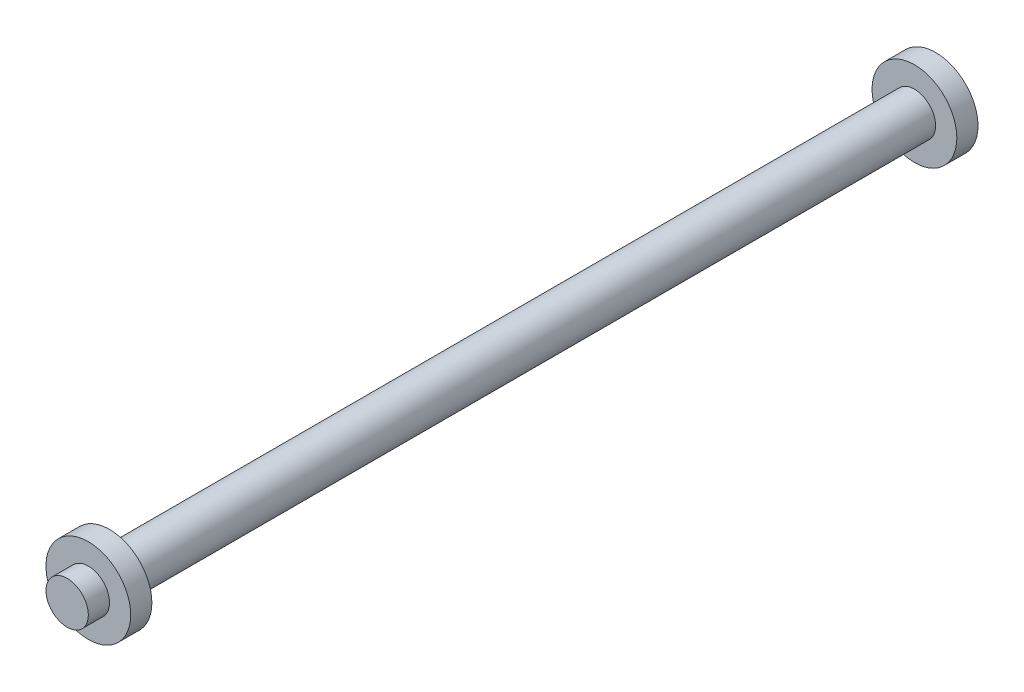
ISO-10303-21;
HEADER;
FILE_DESCRIPTION(('STEP AP214'),'2;1');
FILE_NAME('part.step','',(''),(''),'','','');
FILE_SCHEMA(('AUTOMOTIVE_DESIGN { 1 0 10303 214 1 1 1 1 }'));
ENDSEC;
DATA;
#1=APPLICATION_CONTEXT('core data for automotive mechanical design processes');
#2=APPLICATION_PROTOCOL_DEFINITION('international standard','automotive_design',2000,#1);
#3=PRODUCT_CONTEXT('',#1,'mechanical');
#4=PRODUCT('Part','Part','',(#3));
#5=PRODUCT_RELATED_PRODUCT_CATEGORY('part','',(#4));
#6=PRODUCT_DEFINITION_FORMATION('','',#4);
#7=PRODUCT_DEFINITION_CONTEXT('part definition',#1,'design');
#8=PRODUCT_DEFINITION('design','',#6,#7);
#9=PRODUCT_DEFINITION_SHAPE('','',#8);
#10=(LENGTH_UNIT() NAMED_UNIT(*) SI_UNIT(.MILLI.,.METRE.));
#11=(NAMED_UNIT(*) PLANE_ANGLE_UNIT() SI_UNIT($,.RADIAN.));
#12=(NAMED_UNIT(*) SI_UNIT($,.STERADIAN.) SOLID_ANGLE_UNIT());
#13=UNCERTAINTY_MEASURE_WITH_UNIT(LENGTH_MEASURE(1.E-05),#10,'distance_accuracy_value','');
#14=(GEOMETRIC_REPRESENTATION_CONTEXT(3) GLOBAL_UNCERTAINTY_ASSIGNED_CONTEXT((#13)) GLOBAL_UNIT_ASSIGNED_CONTEXT((#10,
#11,#12)) REPRESENTATION_CONTEXT('',''));
#15=CARTESIAN_POINT('',(0.,0.,0.));
#16=DIRECTION('',(0.,0.,1.));
#17=DIRECTION('',(1.,0.,0.));
#18=AXIS2_PLACEMENT_3D('',#15,#16,#17);
#19=CARTESIAN_POINT('',(0.,0.,-380.));
#20=DIRECTION('',(0.,0.,-1.));
#21=DIRECTION('',(-1.,0.,0.));
#22=AXIS2_PLACEMENT_3D('',#19,#20,#21);
#23=PLANE('',#22);
#24=CARTESIAN_POINT('',(0.,0.,-380.));
#25=DIRECTION('',(0.,0.,-1.));
#26=DIRECTION('',(1.,0.,0.));
#27=AXIS2_PLACEMENT_3D('',#24,#25,#26);
#28=CIRCLE('',#27,10.);
#29=CARTESIAN_POINT('',(10.,1.69E-13,-380.));
#30=VERTEX_POINT('',#29);
#31=EDGE_CURVE('E89',#30,#30,#28,.T.);
#32=ORIENTED_EDGE('',*,*,#31,.T.);
#33=EDGE_LOOP('',(#32));
#34=FACE_BOUND('',#33,.T.);
#35=CARTESIAN_POINT('',(0.,0.,-380.));
#36=DIRECTION('',(0.,0.,-1.));
#37=DIRECTION('',(1.,0.,0.));
#38=AXIS2_PLACEMENT_3D('',#35,#36,#37);
#39=CIRCLE('',#38,20.);
#40=CARTESIAN_POINT('',(20.,1.69E-13,-380.));
#41=VERTEX_POINT('',#40);
#42=EDGE_CURVE('E11',#41,#41,#39,.T.);
#43=ORIENTED_EDGE('',*,*,#42,.F.);
#44=EDGE_LOOP('',(#43));
#45=FACE_BOUND('',#44,.T.);
#46=ADVANCED_FACE('F19',(#34,#45),#23,.F.);
#47=CARTESIAN_POINT('',(0.,0.,-390.));
#48=DIRECTION('',(0.,0.,1.));
#49=DIRECTION('',(1.,0.,0.));
#50=AXIS2_PLACEMENT_3D('',#47,#48,#49);
#51=CYLINDRICAL_SURFACE('',#50,20.);
#52=DIRECTION('',(0.,0.,1.));
#53=VECTOR('',#52,1.);
#54=CARTESIAN_POINT('',(20.,0.,-390.));
#55=LINE('',#54,#53);
#56=CARTESIAN_POINT('',(20.,1.73E-13,-390.));
#57=VERTEX_POINT('',#56);
#58=EDGE_CURVE('E29',#57,#41,#55,.T.);
#59=ORIENTED_EDGE('',*,*,#58,.T.);
#60=ORIENTED_EDGE('',*,*,#42,.T.);
#61=ORIENTED_EDGE('',*,*,#58,.F.);
#62=CARTESIAN_POINT('',(0.,0.,-390.));
#63=DIRECTION('',(0.,0.,-1.));
#64=DIRECTION('',(1.,0.,0.));
#65=AXIS2_PLACEMENT_3D('',#62,#63,#64);
#66=CIRCLE('',#65,20.);
#67=EDGE_CURVE('E81',#57,#57,#66,.T.);
#68=ORIENTED_EDGE('',*,*,#67,.F.);
#69=EDGE_LOOP('',(#59,#60,#61,#68));
#70=FACE_BOUND('',#69,.T.);
#71=ADVANCED_FACE('F134',(#70),#51,.T.);
#72=CARTESIAN_POINT('',(0.,0.,-390.));
#73=DIRECTION('',(0.,0.,-1.));
#74=DIRECTION('',(-1.,0.,0.));
#75=AXIS2_PLACEMENT_3D('',#72,#73,#74);
#76=PLANE('',#75);
#77=ORIENTED_EDGE('',*,*,#67,.T.);
#78=EDGE_LOOP('',(#77));
#79=FACE_BOUND('',#78,.T.);
#80=ADVANCED_FACE('F139',(#79),#76,.T.);
#81=CARTESIAN_POINT('',(0.,0.,20.));
#82=DIRECTION('',(0.,0.,-1.));
#83=DIRECTION('',(-1.,0.,0.));
#84=AXIS2_PLACEMENT_3D('',#81,#82,#83);
#85=PLANE('',#84);
#86=CARTESIAN_POINT('',(0.,0.,20.));
#87=DIRECTION('',(0.,0.,-1.));
#88=DIRECTION('',(1.,0.,0.));
#89=AXIS2_PLACEMENT_3D('',#86,#87,#88);
#90=CIRCLE('',#89,10.);
#91=CARTESIAN_POINT('',(10.,0.,20.));
#92=VERTEX_POINT('',#91);
#93=EDGE_CURVE('E64',#92,#92,#90,.T.);
#94=ORIENTED_EDGE('',*,*,#93,.F.);
#95=EDGE_LOOP('',(#94));
#96=FACE_BOUND('',#95,.T.);
#97=ADVANCED_FACE('F143',(#96),#85,.F.);
#98=CARTESIAN_POINT('',(0.,0.,10.));
#99=DIRECTION('',(0.,0.,1.));
#100=DIRECTION('',(1.,0.,0.));
#101=AXIS2_PLACEMENT_3D('',#98,#99,#100);
#102=CYLINDRICAL_SURFACE('',#101,10.);
#103=DIRECTION('',(0.,0.,1.));
#104=VECTOR('',#103,1.);
#105=CARTESIAN_POINT('',(10.,0.,10.));
#106=LINE('',#105,#104);
#107=CARTESIAN_POINT('',(10.,0.,10.));
#108=VERTEX_POINT('',#107);
#109=EDGE_CURVE('E59',#108,#92,#106,.T.);
#110=ORIENTED_EDGE('',*,*,#109,.T.);
#111=ORIENTED_EDGE('',*,*,#93,.T.);
#112=ORIENTED_EDGE('',*,*,#109,.F.);
#113=CARTESIAN_POINT('',(0.,0.,10.));
#114=DIRECTION('',(0.,0.,-1.));
#115=DIRECTION('',(1.,0.,0.));
#116=AXIS2_PLACEMENT_3D('',#113,#114,#115);
#117=CIRCLE('',#116,10.);
#118=EDGE_CURVE('E62',#108,#108,#117,.T.);
#119=ORIENTED_EDGE('',*,*,#118,.F.);
#120=EDGE_LOOP('',(#110,#111,#112,#119));
#121=FACE_BOUND('',#120,.T.);
#122=ADVANCED_FACE('F61',(#121),#102,.T.);
#123=CARTESIAN_POINT('',(0.,0.,10.));
#124=DIRECTION('',(0.,0.,-1.));
#125=DIRECTION('',(-1.,0.,0.));
#126=AXIS2_PLACEMENT_3D('',#123,#124,#125);
#127=PLANE('',#126);
#128=ORIENTED_EDGE('',*,*,#118,.T.);
#129=EDGE_LOOP('',(#128));
#130=FACE_BOUND('',#129,.T.);
#131=CARTESIAN_POINT('',(0.,0.,10.));
#132=DIRECTION('',(0.,0.,-1.));
#133=DIRECTION('',(1.,0.,0.));
#134=AXIS2_PLACEMENT_3D('',#131,#132,#133);
#135=CIRCLE('',#134,20.);
#136=CARTESIAN_POINT('',(20.,0.,10.));
#137=VERTEX_POINT('',#136);
#138=EDGE_CURVE('E71',#137,#137,#135,.T.);
#139=ORIENTED_EDGE('',*,*,#138,.F.);
#140=EDGE_LOOP('',(#139));
#141=FACE_BOUND('',#140,.T.);
#142=ADVANCED_FACE('F68',(#130,#141),#127,.F.);
#143=CARTESIAN_POINT('',(0.,0.,0.));
#144=DIRECTION('',(0.,0.,1.));
#145=DIRECTION('',(1.,0.,0.));
#146=AXIS2_PLACEMENT_3D('',#143,#144,#145);
#147=CYLINDRICAL_SURFACE('',#146,20.);
#148=DIRECTION('',(0.,0.,1.));
#149=VECTOR('',#148,1.);
#150=CARTESIAN_POINT('',(20.,0.,0.));
#151=LINE('',#150,#149);
#152=CARTESIAN_POINT('',(20.,0.,0.));
#153=VERTEX_POINT('',#152);
#154=EDGE_CURVE('E77',#153,#137,#151,.T.);
#155=ORIENTED_EDGE('',*,*,#154,.T.);
#156=ORIENTED_EDGE('',*,*,#138,.T.);
#157=ORIENTED_EDGE('',*,*,#154,.F.);
#158=CARTESIAN_POINT('',(0.,0.,0.));
#159=DIRECTION('',(0.,0.,-1.));
#160=DIRECTION('',(1.,0.,0.));
#161=AXIS2_PLACEMENT_3D('',#158,#159,#160);
#162=CIRCLE('',#161,20.);
#163=EDGE_CURVE('E86',#153,#153,#162,.T.);
#164=ORIENTED_EDGE('',*,*,#163,.F.);
#165=EDGE_LOOP('',(#155,#156,#157,#164));
#166=FACE_BOUND('',#165,.T.);
#167=ADVANCED_FACE('F121',(#166),#147,.T.);
#168=CARTESIAN_POINT('',(0.,0.,0.));
#169=DIRECTION('',(0.,0.,-1.));
#170=DIRECTION('',(-1.,0.,0.));
#171=AXIS2_PLACEMENT_3D('',#168,#169,#170);
#172=PLANE('',#171);
#173=ORIENTED_EDGE('',*,*,#163,.T.);
#174=EDGE_LOOP('',(#173));
#175=FACE_BOUND('',#174,.T.);
#176=CARTESIAN_POINT('',(0.,0.,0.));
#177=DIRECTION('',(0.,0.,-1.));
#178=DIRECTION('',(1.,0.,0.));
#179=AXIS2_PLACEMENT_3D('',#176,#177,#178);
#180=CIRCLE('',#179,10.);
#181=CARTESIAN_POINT('',(10.,0.,0.));
#182=VERTEX_POINT('',#181);
#183=EDGE_CURVE('E99',#182,#182,#180,.T.);
#184=ORIENTED_EDGE('',*,*,#183,.F.);
#185=EDGE_LOOP('',(#184));
#186=FACE_BOUND('',#185,.T.);
#187=ADVANCED_FACE('F21',(#175,#186),#172,.T.);
#188=CARTESIAN_POINT('',(0.,0.,-380.));
#189=DIRECTION('',(0.,0.,1.));
#190=DIRECTION('',(1.,0.,0.));
#191=AXIS2_PLACEMENT_3D('',#188,#189,#190);
#192=CYLINDRICAL_SURFACE('',#191,10.);
#193=DIRECTION('',(0.,0.,1.));
#194=VECTOR('',#193,1.);
#195=CARTESIAN_POINT('',(10.,0.,-380.));
#196=LINE('',#195,#194);
#197=EDGE_CURVE('E80',#30,#182,#196,.T.);
#198=ORIENTED_EDGE('',*,*,#197,.T.);
#199=ORIENTED_EDGE('',*,*,#183,.T.);
#200=ORIENTED_EDGE('',*,*,#197,.F.);
#201=ORIENTED_EDGE('',*,*,#31,.F.);
#202=EDGE_LOOP('',(#198,#199,#200,#201));
#203=FACE_BOUND('',#202,.T.);
#204=ADVANCED_FACE('F109',(#203),#192,.T.);
#205=CLOSED_SHELL('',(#46,#71,#80,#97,#122,#142,#167,#187,#204));
#206=MANIFOLD_SOLID_BREP('B1',#205);
#207=ADVANCED_BREP_SHAPE_REPRESENTATION('',(#18,#206),#14);
#208=SHAPE_DEFINITION_REPRESENTATION(#9,#207);
ENDSEC;
END-ISO-10303-21;
